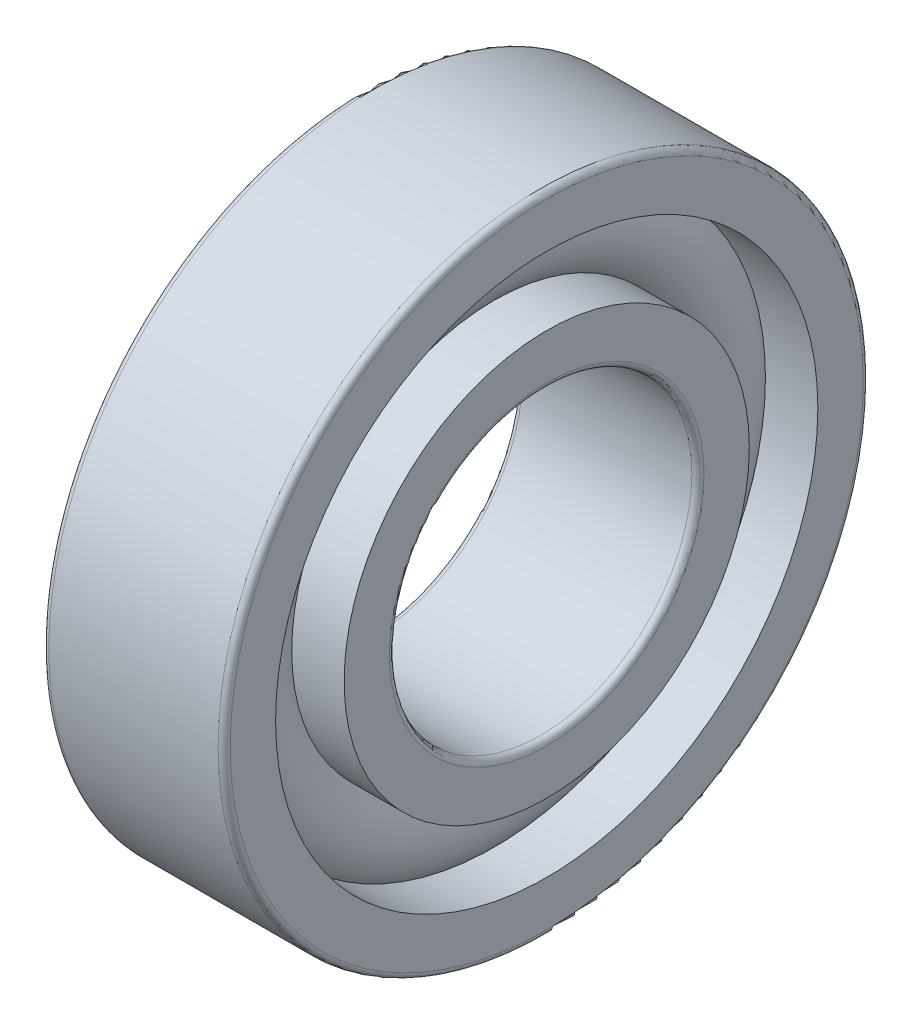
ISO-10303-21;
HEADER;
FILE_DESCRIPTION(('STEP AP214'),'2;1');
FILE_NAME('part.step','',(''),(''),'','','');
FILE_SCHEMA(('AUTOMOTIVE_DESIGN { 1 0 10303 214 1 1 1 1 }'));
ENDSEC;
DATA;
#1=APPLICATION_CONTEXT('core data for automotive mechanical design processes');
#2=APPLICATION_PROTOCOL_DEFINITION('international standard','automotive_design',2000,#1);
#3=PRODUCT_CONTEXT('',#1,'mechanical');
#4=PRODUCT('Part','Part','',(#3));
#5=PRODUCT_RELATED_PRODUCT_CATEGORY('part','',(#4));
#6=PRODUCT_DEFINITION_FORMATION('','',#4);
#7=PRODUCT_DEFINITION_CONTEXT('part definition',#1,'design');
#8=PRODUCT_DEFINITION('design','',#6,#7);
#9=PRODUCT_DEFINITION_SHAPE('','',#8);
#10=(LENGTH_UNIT() NAMED_UNIT(*) SI_UNIT(.MILLI.,.METRE.));
#11=(NAMED_UNIT(*) PLANE_ANGLE_UNIT() SI_UNIT($,.RADIAN.));
#12=(NAMED_UNIT(*) SI_UNIT($,.STERADIAN.) SOLID_ANGLE_UNIT());
#13=UNCERTAINTY_MEASURE_WITH_UNIT(LENGTH_MEASURE(1.E-05),#10,'distance_accuracy_value','');
#14=(GEOMETRIC_REPRESENTATION_CONTEXT(3) GLOBAL_UNCERTAINTY_ASSIGNED_CONTEXT((#13)) GLOBAL_UNIT_ASSIGNED_CONTEXT((#10,
#11,#12)) REPRESENTATION_CONTEXT('',''));
#15=CARTESIAN_POINT('',(0.,0.,0.));
#16=DIRECTION('',(0.,0.,1.));
#17=DIRECTION('',(1.,0.,0.));
#18=AXIS2_PLACEMENT_3D('',#15,#16,#17);
#19=CARTESIAN_POINT('',(0.,0.,0.));
#20=DIRECTION('',(-1.,0.,0.));
#21=DIRECTION('',(0.,0.,1.));
#22=AXIS2_PLACEMENT_3D('',#19,#20,#21);
#23=TOROIDAL_SURFACE('',#22,11.75,2.55);
#24=CARTESIAN_POINT('',(1.90065778087482,0.,0.));
#25=DIRECTION('',(-1.,0.,0.));
#26=DIRECTION('',(0.,0.,1.));
#27=AXIS2_PLACEMENT_3D('',#24,#25,#26);
#28=CIRCLE('',#27,13.45);
#29=CARTESIAN_POINT('',(1.90065778087482,0.,13.45));
#30=VERTEX_POINT('',#29);
#31=EDGE_CURVE('E36',#30,#30,#28,.F.);
#32=ORIENTED_EDGE('',*,*,#31,.T.);
#33=EDGE_LOOP('',(#32));
#34=FACE_BOUND('',#33,.T.);
#35=CARTESIAN_POINT('',(1.90065778087482,0.,0.));
#36=DIRECTION('',(-1.,0.,0.));
#37=DIRECTION('',(0.,0.,1.));
#38=AXIS2_PLACEMENT_3D('',#35,#36,#37);
#39=CIRCLE('',#38,10.05);
#40=CARTESIAN_POINT('',(1.90065778087482,0.,10.05));
#41=VERTEX_POINT('',#40);
#42=EDGE_CURVE('E10',#41,#41,#39,.T.);
#43=ORIENTED_EDGE('',*,*,#42,.T.);
#44=EDGE_LOOP('',(#43));
#45=FACE_BOUND('',#44,.T.);
#46=ADVANCED_FACE('F32',(#34,#45),#23,.T.);
#47=CARTESIAN_POINT('',(-20.6375,0.,0.));
#48=DIRECTION('',(1.,0.,0.));
#49=DIRECTION('',(0.,0.,-1.));
#50=AXIS2_PLACEMENT_3D('',#47,#48,#49);
#51=CYLINDRICAL_SURFACE('',#50,10.05);
#52=CARTESIAN_POINT('',(4.5,0.,0.));
#53=DIRECTION('',(1.,0.,0.));
#54=DIRECTION('',(0.,0.,-1.));
#55=AXIS2_PLACEMENT_3D('',#52,#53,#54);
#56=CIRCLE('',#55,10.05);
#57=CARTESIAN_POINT('',(4.5,0.,-10.05));
#58=VERTEX_POINT('',#57);
#59=EDGE_CURVE('E45',#58,#58,#56,.T.);
#60=ORIENTED_EDGE('',*,*,#59,.F.);
#61=EDGE_LOOP('',(#60));
#62=FACE_BOUND('',#61,.T.);
#63=ORIENTED_EDGE('',*,*,#42,.F.);
#64=EDGE_LOOP('',(#63));
#65=FACE_BOUND('',#64,.T.);
#66=ADVANCED_FACE('F84',(#62,#65),#51,.T.);
#67=CARTESIAN_POINT('',(-20.6375,0.,0.));
#68=DIRECTION('',(1.,0.,0.));
#69=DIRECTION('',(0.,0.,-1.));
#70=AXIS2_PLACEMENT_3D('',#67,#68,#69);
#71=CYLINDRICAL_SURFACE('',#70,10.05);
#72=CARTESIAN_POINT('',(-4.5,0.,0.));
#73=DIRECTION('',(1.,0.,0.));
#74=DIRECTION('',(0.,0.,-1.));
#75=AXIS2_PLACEMENT_3D('',#72,#73,#74);
#76=CIRCLE('',#75,10.05);
#77=CARTESIAN_POINT('',(-4.5,0.,-10.05));
#78=VERTEX_POINT('',#77);
#79=EDGE_CURVE('E54',#78,#78,#76,.T.);
#80=ORIENTED_EDGE('',*,*,#79,.T.);
#81=EDGE_LOOP('',(#80));
#82=FACE_BOUND('',#81,.T.);
#83=CARTESIAN_POINT('',(-1.90065778087482,0.,0.));
#84=DIRECTION('',(1.,0.,0.));
#85=DIRECTION('',(0.,0.,-1.));
#86=AXIS2_PLACEMENT_3D('',#83,#84,#85);
#87=CIRCLE('',#86,10.05);
#88=CARTESIAN_POINT('',(-1.90065778087482,0.,-10.05));
#89=VERTEX_POINT('',#88);
#90=EDGE_CURVE('E40',#89,#89,#87,.T.);
#91=ORIENTED_EDGE('',*,*,#90,.F.);
#92=EDGE_LOOP('',(#91));
#93=FACE_BOUND('',#92,.T.);
#94=ADVANCED_FACE('F87',(#82,#93),#71,.T.);
#95=CARTESIAN_POINT('',(4.5,7.8,0.));
#96=DIRECTION('',(1.,0.,0.));
#97=DIRECTION('',(0.,0.,-1.));
#98=AXIS2_PLACEMENT_3D('',#95,#96,#97);
#99=PLANE('',#98);
#100=ORIENTED_EDGE('',*,*,#59,.T.);
#101=EDGE_LOOP('',(#100));
#102=FACE_BOUND('',#101,.T.);
#103=CARTESIAN_POINT('',(4.5,0.,0.));
#104=DIRECTION('',(1.,0.,0.));
#105=DIRECTION('',(0.,0.,-1.));
#106=AXIS2_PLACEMENT_3D('',#103,#104,#105);
#107=CIRCLE('',#106,7.8);
#108=CARTESIAN_POINT('',(4.5,0.,-7.8));
#109=VERTEX_POINT('',#108);
#110=EDGE_CURVE('E76',#109,#109,#107,.T.);
#111=ORIENTED_EDGE('',*,*,#110,.F.);
#112=EDGE_LOOP('',(#111));
#113=FACE_BOUND('',#112,.T.);
#114=ADVANCED_FACE('F81',(#102,#113),#99,.T.);
#115=CARTESIAN_POINT('',(4.2,0.,0.));
#116=DIRECTION('',(1.,0.,0.));
#117=DIRECTION('',(0.,0.,-1.));
#118=AXIS2_PLACEMENT_3D('',#115,#116,#117);
#119=TOROIDAL_SURFACE('',#118,7.8,0.3);
#120=ORIENTED_EDGE('',*,*,#110,.T.);
#121=EDGE_LOOP('',(#120));
#122=FACE_BOUND('',#121,.T.);
#123=CARTESIAN_POINT('',(4.2,0.,0.));
#124=DIRECTION('',(1.,0.,0.));
#125=DIRECTION('',(0.,0.,-1.));
#126=AXIS2_PLACEMENT_3D('',#123,#124,#125);
#127=CIRCLE('',#126,7.5);
#128=CARTESIAN_POINT('',(4.2,0.,-7.5));
#129=VERTEX_POINT('',#128);
#130=EDGE_CURVE('E73',#129,#129,#127,.T.);
#131=ORIENTED_EDGE('',*,*,#130,.F.);
#132=EDGE_LOOP('',(#131));
#133=FACE_BOUND('',#132,.T.);
#134=ADVANCED_FACE('F98',(#122,#133),#119,.T.);
#135=CARTESIAN_POINT('',(-20.6375,0.,0.));
#136=DIRECTION('',(1.,0.,0.));
#137=DIRECTION('',(0.,0.,-1.));
#138=AXIS2_PLACEMENT_3D('',#135,#136,#137);
#139=CYLINDRICAL_SURFACE('',#138,7.5);
#140=ORIENTED_EDGE('',*,*,#130,.T.);
#141=EDGE_LOOP('',(#140));
#142=FACE_BOUND('',#141,.T.);
#143=CARTESIAN_POINT('',(-4.2,0.,0.));
#144=DIRECTION('',(1.,0.,0.));
#145=DIRECTION('',(0.,0.,-1.));
#146=AXIS2_PLACEMENT_3D('',#143,#144,#145);
#147=CIRCLE('',#146,7.5);
#148=CARTESIAN_POINT('',(-4.2,0.,-7.5));
#149=VERTEX_POINT('',#148);
#150=EDGE_CURVE('E70',#149,#149,#147,.T.);
#151=ORIENTED_EDGE('',*,*,#150,.F.);
#152=EDGE_LOOP('',(#151));
#153=FACE_BOUND('',#152,.T.);
#154=ADVANCED_FACE('F101',(#142,#153),#139,.F.);
#155=CARTESIAN_POINT('',(-4.2,0.,0.));
#156=DIRECTION('',(1.,0.,0.));
#157=DIRECTION('',(0.,0.,-1.));
#158=AXIS2_PLACEMENT_3D('',#155,#156,#157);
#159=TOROIDAL_SURFACE('',#158,7.8,0.3);
#160=ORIENTED_EDGE('',*,*,#150,.T.);
#161=EDGE_LOOP('',(#160));
#162=FACE_BOUND('',#161,.T.);
#163=CARTESIAN_POINT('',(-4.5,0.,0.));
#164=DIRECTION('',(1.,0.,0.));
#165=DIRECTION('',(0.,0.,-1.));
#166=AXIS2_PLACEMENT_3D('',#163,#164,#165);
#167=CIRCLE('',#166,7.8);
#168=CARTESIAN_POINT('',(-4.5,0.,-7.8));
#169=VERTEX_POINT('',#168);
#170=EDGE_CURVE('E67',#169,#169,#167,.T.);
#171=ORIENTED_EDGE('',*,*,#170,.F.);
#172=EDGE_LOOP('',(#171));
#173=FACE_BOUND('',#172,.T.);
#174=ADVANCED_FACE('F105',(#162,#173),#159,.T.);
#175=CARTESIAN_POINT('',(-4.5,10.05,0.));
#176=DIRECTION('',(-1.,0.,0.));
#177=DIRECTION('',(0.,0.,1.));
#178=AXIS2_PLACEMENT_3D('',#175,#176,#177);
#179=PLANE('',#178);
#180=ORIENTED_EDGE('',*,*,#170,.T.);
#181=EDGE_LOOP('',(#180));
#182=FACE_BOUND('',#181,.T.);
#183=ORIENTED_EDGE('',*,*,#79,.F.);
#184=EDGE_LOOP('',(#183));
#185=FACE_BOUND('',#184,.T.);
#186=ADVANCED_FACE('F109',(#182,#185),#179,.T.);
#187=CARTESIAN_POINT('',(-1.90065778087482,0.,0.));
#188=DIRECTION('',(1.,0.,0.));
#189=DIRECTION('',(0.,0.,-1.));
#190=AXIS2_PLACEMENT_3D('',#187,#188,#189);
#191=CIRCLE('',#190,13.45);
#192=CARTESIAN_POINT('',(-1.90065778087482,0.,-13.45));
#193=VERTEX_POINT('',#192);
#194=EDGE_CURVE('E48',#193,#193,#191,.F.);
#195=ORIENTED_EDGE('',*,*,#194,.T.);
#196=EDGE_LOOP('',(#195));
#197=FACE_BOUND('',#196,.T.);
#198=ORIENTED_EDGE('',*,*,#90,.T.);
#199=EDGE_LOOP('',(#198));
#200=FACE_BOUND('',#199,.T.);
#201=ADVANCED_FACE('F34',(#197,#200),#23,.T.);
#202=CARTESIAN_POINT('',(-20.6375,0.,0.));
#203=DIRECTION('',(1.,0.,0.));
#204=DIRECTION('',(0.,0.,-1.));
#205=AXIS2_PLACEMENT_3D('',#202,#203,#204);
#206=CYLINDRICAL_SURFACE('',#205,13.45);
#207=CARTESIAN_POINT('',(4.5,0.,0.));
#208=DIRECTION('',(1.,0.,0.));
#209=DIRECTION('',(0.,0.,-1.));
#210=AXIS2_PLACEMENT_3D('',#207,#208,#209);
#211=CIRCLE('',#210,13.45);
#212=CARTESIAN_POINT('',(4.5,0.,-13.45));
#213=VERTEX_POINT('',#212);
#214=EDGE_CURVE('E50',#213,#213,#211,.T.);
#215=ORIENTED_EDGE('',*,*,#214,.T.);
#216=EDGE_LOOP('',(#215));
#217=FACE_BOUND('',#216,.T.);
#218=ORIENTED_EDGE('',*,*,#31,.F.);
#219=EDGE_LOOP('',(#218));
#220=FACE_BOUND('',#219,.T.);
#221=ADVANCED_FACE('F114',(#217,#220),#206,.F.);
#222=CARTESIAN_POINT('',(-20.6375,0.,0.));
#223=DIRECTION('',(1.,0.,0.));
#224=DIRECTION('',(0.,0.,-1.));
#225=AXIS2_PLACEMENT_3D('',#222,#223,#224);
#226=CYLINDRICAL_SURFACE('',#225,13.45);
#227=CARTESIAN_POINT('',(-4.5,0.,0.));
#228=DIRECTION('',(1.,0.,0.));
#229=DIRECTION('',(0.,0.,-1.));
#230=AXIS2_PLACEMENT_3D('',#227,#228,#229);
#231=CIRCLE('',#230,13.45);
#232=CARTESIAN_POINT('',(-4.5,0.,-13.45));
#233=VERTEX_POINT('',#232);
#234=EDGE_CURVE('E145',#233,#233,#231,.T.);
#235=ORIENTED_EDGE('',*,*,#234,.F.);
#236=EDGE_LOOP('',(#235));
#237=FACE_BOUND('',#236,.T.);
#238=ORIENTED_EDGE('',*,*,#194,.F.);
#239=EDGE_LOOP('',(#238));
#240=FACE_BOUND('',#239,.T.);
#241=ADVANCED_FACE('F117',(#237,#240),#226,.F.);
#242=CARTESIAN_POINT('',(4.5,15.7,0.));
#243=DIRECTION('',(1.,0.,0.));
#244=DIRECTION('',(0.,0.,-1.));
#245=AXIS2_PLACEMENT_3D('',#242,#243,#244);
#246=PLANE('',#245);
#247=CARTESIAN_POINT('',(4.5,0.,0.));
#248=DIRECTION('',(1.,0.,0.));
#249=DIRECTION('',(0.,0.,-1.));
#250=AXIS2_PLACEMENT_3D('',#247,#248,#249);
#251=CIRCLE('',#250,15.7);
#252=CARTESIAN_POINT('',(4.5,0.,-15.7));
#253=VERTEX_POINT('',#252);
#254=EDGE_CURVE('E56',#253,#253,#251,.T.);
#255=ORIENTED_EDGE('',*,*,#254,.T.);
#256=EDGE_LOOP('',(#255));
#257=FACE_BOUND('',#256,.T.);
#258=ORIENTED_EDGE('',*,*,#214,.F.);
#259=EDGE_LOOP('',(#258));
#260=FACE_BOUND('',#259,.T.);
#261=ADVANCED_FACE('F118',(#257,#260),#246,.T.);
#262=CARTESIAN_POINT('',(4.2,0.,0.));
#263=DIRECTION('',(1.,0.,0.));
#264=DIRECTION('',(0.,0.,-1.));
#265=AXIS2_PLACEMENT_3D('',#262,#263,#264);
#266=TOROIDAL_SURFACE('',#265,15.7,0.300000000000001);
#267=CARTESIAN_POINT('',(4.2,0.,0.));
#268=DIRECTION('',(1.,0.,0.));
#269=DIRECTION('',(0.,0.,-1.));
#270=AXIS2_PLACEMENT_3D('',#267,#268,#269);
#271=CIRCLE('',#270,16.);
#272=CARTESIAN_POINT('',(4.2,0.,-16.));
#273=VERTEX_POINT('',#272);
#274=EDGE_CURVE('E61',#273,#273,#271,.T.);
#275=ORIENTED_EDGE('',*,*,#274,.T.);
#276=EDGE_LOOP('',(#275));
#277=FACE_BOUND('',#276,.T.);
#278=ORIENTED_EDGE('',*,*,#254,.F.);
#279=EDGE_LOOP('',(#278));
#280=FACE_BOUND('',#279,.T.);
#281=ADVANCED_FACE('F121',(#277,#280),#266,.T.);
#282=CARTESIAN_POINT('',(-20.6375,0.,0.));
#283=DIRECTION('',(1.,0.,0.));
#284=DIRECTION('',(0.,0.,-1.));
#285=AXIS2_PLACEMENT_3D('',#282,#283,#284);
#286=CYLINDRICAL_SURFACE('',#285,16.);
#287=CARTESIAN_POINT('',(-4.2,0.,0.));
#288=DIRECTION('',(1.,0.,0.));
#289=DIRECTION('',(0.,0.,-1.));
#290=AXIS2_PLACEMENT_3D('',#287,#288,#289);
#291=CIRCLE('',#290,16.);
#292=CARTESIAN_POINT('',(-4.2,0.,-16.));
#293=VERTEX_POINT('',#292);
#294=EDGE_CURVE('E149',#293,#293,#291,.T.);
#295=ORIENTED_EDGE('',*,*,#294,.T.);
#296=EDGE_LOOP('',(#295));
#297=FACE_BOUND('',#296,.T.);
#298=ORIENTED_EDGE('',*,*,#274,.F.);
#299=EDGE_LOOP('',(#298));
#300=FACE_BOUND('',#299,.T.);
#301=ADVANCED_FACE('F125',(#297,#300),#286,.T.);
#302=CARTESIAN_POINT('',(-4.2,0.,0.));
#303=DIRECTION('',(1.,0.,0.));
#304=DIRECTION('',(0.,0.,-1.));
#305=AXIS2_PLACEMENT_3D('',#302,#303,#304);
#306=TOROIDAL_SURFACE('',#305,15.7,0.300000000000001);
#307=CARTESIAN_POINT('',(-4.5,0.,0.));
#308=DIRECTION('',(1.,0.,0.));
#309=DIRECTION('',(0.,0.,-1.));
#310=AXIS2_PLACEMENT_3D('',#307,#308,#309);
#311=CIRCLE('',#310,15.7);
#312=CARTESIAN_POINT('',(-4.5,0.,-15.7));
#313=VERTEX_POINT('',#312);
#314=EDGE_CURVE('E146',#313,#313,#311,.T.);
#315=ORIENTED_EDGE('',*,*,#314,.T.);
#316=EDGE_LOOP('',(#315));
#317=FACE_BOUND('',#316,.T.);
#318=ORIENTED_EDGE('',*,*,#294,.F.);
#319=EDGE_LOOP('',(#318));
#320=FACE_BOUND('',#319,.T.);
#321=ADVANCED_FACE('F129',(#317,#320),#306,.T.);
#322=CARTESIAN_POINT('',(-4.5,13.45,0.));
#323=DIRECTION('',(-1.,0.,0.));
#324=DIRECTION('',(0.,0.,1.));
#325=AXIS2_PLACEMENT_3D('',#322,#323,#324);
#326=PLANE('',#325);
#327=ORIENTED_EDGE('',*,*,#234,.T.);
#328=EDGE_LOOP('',(#327));
#329=FACE_BOUND('',#328,.T.);
#330=ORIENTED_EDGE('',*,*,#314,.F.);
#331=EDGE_LOOP('',(#330));
#332=FACE_BOUND('',#331,.T.);
#333=ADVANCED_FACE('F133',(#329,#332),#326,.T.);
#334=CLOSED_SHELL('',(#46,#66,#94,#114,#134,#154,#174,#186,#201,#221,#241,#261,#281,#301,#321,#333));
#335=MANIFOLD_SOLID_BREP('B2',#334);
#336=ADVANCED_BREP_SHAPE_REPRESENTATION('',(#18,#335),#14);
#337=SHAPE_DEFINITION_REPRESENTATION(#9,#336);
ENDSEC;
END-ISO-10303-21;
